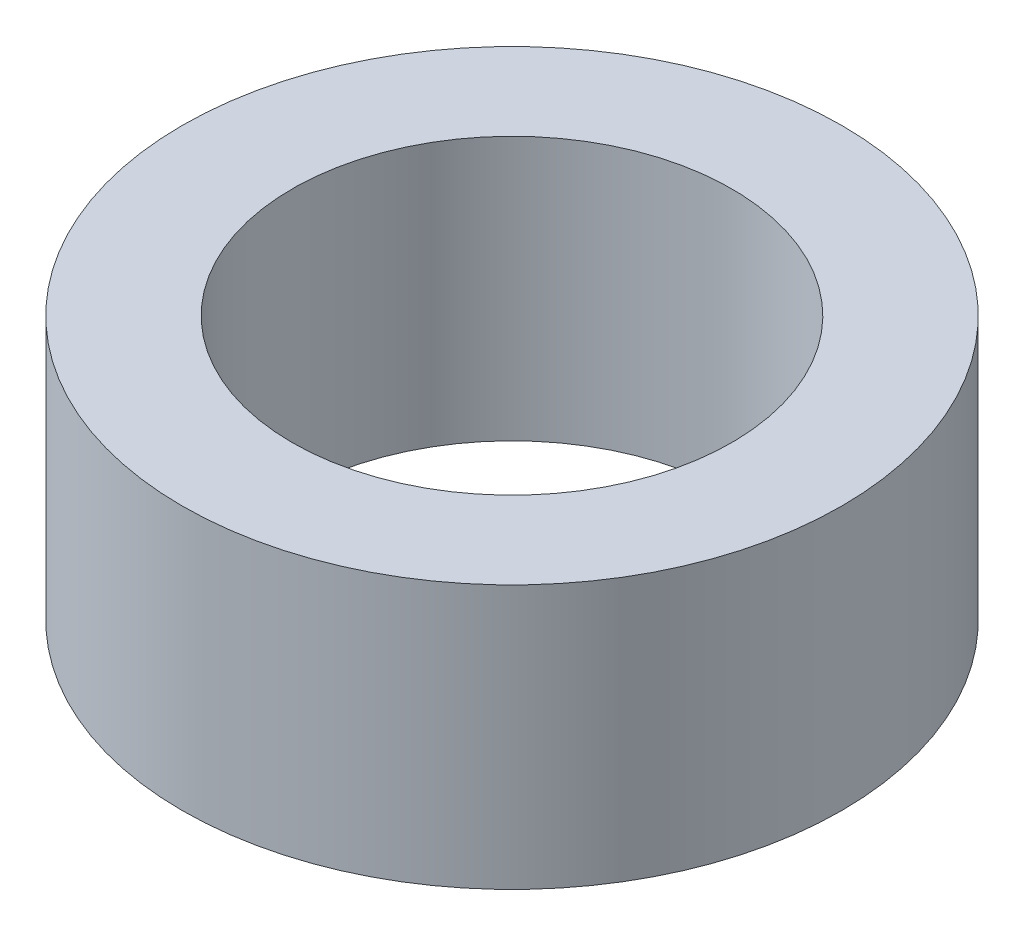
ISO-10303-21;
HEADER;
FILE_DESCRIPTION(('STEP AP214'),'2;1');
FILE_NAME('part.step','',(''),(''),'','','');
FILE_SCHEMA(('AUTOMOTIVE_DESIGN { 1 0 10303 214 1 1 1 1 }'));
ENDSEC;
DATA;
#1=APPLICATION_CONTEXT('core data for automotive mechanical design processes');
#2=APPLICATION_PROTOCOL_DEFINITION('international standard','automotive_design',2000,#1);
#3=PRODUCT_CONTEXT('',#1,'mechanical');
#4=PRODUCT('Part','Part','',(#3));
#5=PRODUCT_RELATED_PRODUCT_CATEGORY('part','',(#4));
#6=PRODUCT_DEFINITION_FORMATION('','',#4);
#7=PRODUCT_DEFINITION_CONTEXT('part definition',#1,'design');
#8=PRODUCT_DEFINITION('design','',#6,#7);
#9=PRODUCT_DEFINITION_SHAPE('','',#8);
#10=(LENGTH_UNIT() NAMED_UNIT(*) SI_UNIT(.MILLI.,.METRE.));
#11=(NAMED_UNIT(*) PLANE_ANGLE_UNIT() SI_UNIT($,.RADIAN.));
#12=(NAMED_UNIT(*) SI_UNIT($,.STERADIAN.) SOLID_ANGLE_UNIT());
#13=UNCERTAINTY_MEASURE_WITH_UNIT(LENGTH_MEASURE(1.E-05),#10,'distance_accuracy_value','');
#14=(GEOMETRIC_REPRESENTATION_CONTEXT(3) GLOBAL_UNCERTAINTY_ASSIGNED_CONTEXT((#13)) GLOBAL_UNIT_ASSIGNED_CONTEXT((#10,
#11,#12)) REPRESENTATION_CONTEXT('',''));
#15=CARTESIAN_POINT('',(0.,0.,0.));
#16=DIRECTION('',(0.,0.,1.));
#17=DIRECTION('',(1.,0.,0.));
#18=AXIS2_PLACEMENT_3D('',#15,#16,#17);
#19=CARTESIAN_POINT('',(0.,24.,0.));
#20=DIRECTION('',(0.,-1.,0.));
#21=DIRECTION('',(0.,0.,-1.));
#22=AXIS2_PLACEMENT_3D('',#19,#20,#21);
#23=CYLINDRICAL_SURFACE('',#22,30.);
#24=CARTESIAN_POINT('',(0.,24.,0.));
#25=DIRECTION('',(0.,1.,0.));
#26=DIRECTION('',(0.,0.,1.));
#27=AXIS2_PLACEMENT_3D('',#24,#25,#26);
#28=CIRCLE('',#27,30.);
#29=CARTESIAN_POINT('',(0.,24.,30.));
#30=VERTEX_POINT('',#29);
#31=EDGE_CURVE('E10',#30,#30,#28,.T.);
#32=ORIENTED_EDGE('',*,*,#31,.F.);
#33=EDGE_LOOP('',(#32));
#34=FACE_BOUND('',#33,.T.);
#35=CARTESIAN_POINT('',(0.,0.,0.));
#36=DIRECTION('',(0.,1.,0.));
#37=DIRECTION('',(0.,0.,1.));
#38=AXIS2_PLACEMENT_3D('',#35,#36,#37);
#39=CIRCLE('',#38,30.);
#40=CARTESIAN_POINT('',(0.,0.,30.));
#41=VERTEX_POINT('',#40);
#42=EDGE_CURVE('E37',#41,#41,#39,.T.);
#43=ORIENTED_EDGE('',*,*,#42,.T.);
#44=EDGE_LOOP('',(#43));
#45=FACE_BOUND('',#44,.T.);
#46=ADVANCED_FACE('F40',(#34,#45),#23,.T.);
#47=CARTESIAN_POINT('',(0.,24.,0.));
#48=DIRECTION('',(0.,1.,0.));
#49=DIRECTION('',(0.,0.,1.));
#50=AXIS2_PLACEMENT_3D('',#47,#48,#49);
#51=PLANE('',#50);
#52=CARTESIAN_POINT('',(0.,24.,0.));
#53=DIRECTION('',(0.,1.,0.));
#54=DIRECTION('',(0.,0.,1.));
#55=AXIS2_PLACEMENT_3D('',#52,#53,#54);
#56=CIRCLE('',#55,20.);
#57=CARTESIAN_POINT('',(0.,24.,20.));
#58=VERTEX_POINT('',#57);
#59=EDGE_CURVE('E50',#58,#58,#56,.T.);
#60=ORIENTED_EDGE('',*,*,#59,.F.);
#61=EDGE_LOOP('',(#60));
#62=FACE_BOUND('',#61,.T.);
#63=ORIENTED_EDGE('',*,*,#31,.T.);
#64=EDGE_LOOP('',(#63));
#65=FACE_BOUND('',#64,.T.);
#66=ADVANCED_FACE('F59',(#62,#65),#51,.T.);
#67=CARTESIAN_POINT('',(0.,0.,0.));
#68=DIRECTION('',(0.,1.,0.));
#69=DIRECTION('',(0.,0.,1.));
#70=AXIS2_PLACEMENT_3D('',#67,#68,#69);
#71=PLANE('',#70);
#72=CARTESIAN_POINT('',(0.,0.,0.));
#73=DIRECTION('',(0.,1.,0.));
#74=DIRECTION('',(0.,0.,1.));
#75=AXIS2_PLACEMENT_3D('',#72,#73,#74);
#76=CIRCLE('',#75,20.);
#77=CARTESIAN_POINT('',(0.,0.,20.));
#78=VERTEX_POINT('',#77);
#79=EDGE_CURVE('E47',#78,#78,#76,.T.);
#80=ORIENTED_EDGE('',*,*,#79,.T.);
#81=EDGE_LOOP('',(#80));
#82=FACE_BOUND('',#81,.T.);
#83=ORIENTED_EDGE('',*,*,#42,.F.);
#84=EDGE_LOOP('',(#83));
#85=FACE_BOUND('',#84,.T.);
#86=ADVANCED_FACE('F58',(#82,#85),#71,.F.);
#87=CARTESIAN_POINT('',(0.,24.,0.));
#88=DIRECTION('',(0.,-1.,0.));
#89=DIRECTION('',(0.,0.,-1.));
#90=AXIS2_PLACEMENT_3D('',#87,#88,#89);
#91=CYLINDRICAL_SURFACE('',#90,20.);
#92=ORIENTED_EDGE('',*,*,#59,.T.);
#93=EDGE_LOOP('',(#92));
#94=FACE_BOUND('',#93,.T.);
#95=ORIENTED_EDGE('',*,*,#79,.F.);
#96=EDGE_LOOP('',(#95));
#97=FACE_BOUND('',#96,.T.);
#98=ADVANCED_FACE('F54',(#94,#97),#91,.F.);
#99=CLOSED_SHELL('',(#46,#66,#86,#98));
#100=MANIFOLD_SOLID_BREP('B2',#99);
#101=ADVANCED_BREP_SHAPE_REPRESENTATION('',(#18,#100),#14);
#102=SHAPE_DEFINITION_REPRESENTATION(#9,#101);
ENDSEC;
END-ISO-10303-21;
